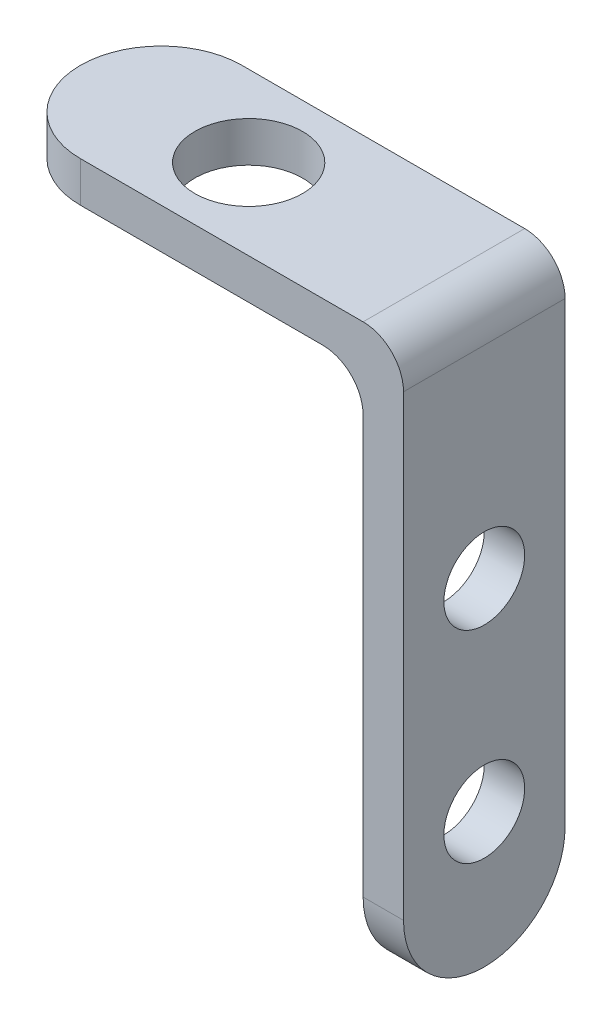
ISO-10303-21;
HEADER;
FILE_DESCRIPTION(('STEP AP214'),'2;1');
FILE_NAME('part.step','',(''),(''),'','','');
FILE_SCHEMA(('AUTOMOTIVE_DESIGN { 1 0 10303 214 1 1 1 1 }'));
ENDSEC;
DATA;
#1=APPLICATION_CONTEXT('core data for automotive mechanical design processes');
#2=APPLICATION_PROTOCOL_DEFINITION('international standard','automotive_design',2000,#1);
#3=PRODUCT_CONTEXT('',#1,'mechanical');
#4=PRODUCT('Part','Part','',(#3));
#5=PRODUCT_RELATED_PRODUCT_CATEGORY('part','',(#4));
#6=PRODUCT_DEFINITION_FORMATION('','',#4);
#7=PRODUCT_DEFINITION_CONTEXT('part definition',#1,'design');
#8=PRODUCT_DEFINITION('design','',#6,#7);
#9=PRODUCT_DEFINITION_SHAPE('','',#8);
#10=(LENGTH_UNIT() NAMED_UNIT(*) SI_UNIT(.MILLI.,.METRE.));
#11=(NAMED_UNIT(*) PLANE_ANGLE_UNIT() SI_UNIT($,.RADIAN.));
#12=(NAMED_UNIT(*) SI_UNIT($,.STERADIAN.) SOLID_ANGLE_UNIT());
#13=UNCERTAINTY_MEASURE_WITH_UNIT(LENGTH_MEASURE(1.E-05),#10,'distance_accuracy_value','');
#14=(GEOMETRIC_REPRESENTATION_CONTEXT(3) GLOBAL_UNCERTAINTY_ASSIGNED_CONTEXT((#13)) GLOBAL_UNIT_ASSIGNED_CONTEXT((#10,
#11,#12)) REPRESENTATION_CONTEXT('',''));
#15=CARTESIAN_POINT('',(0.,0.,0.));
#16=DIRECTION('',(0.,0.,1.));
#17=DIRECTION('',(1.,0.,0.));
#18=AXIS2_PLACEMENT_3D('',#15,#16,#17);
#19=CARTESIAN_POINT('',(0.,0.,0.));
#20=DIRECTION('',(0.,1.,0.));
#21=DIRECTION('',(0.,0.,1.));
#22=AXIS2_PLACEMENT_3D('',#19,#20,#21);
#23=PLANE('',#22);
#24=CARTESIAN_POINT('',(-2.5,0.,0.));
#25=DIRECTION('',(0.,1.,0.));
#26=DIRECTION('',(0.,0.,1.));
#27=AXIS2_PLACEMENT_3D('',#24,#25,#26);
#28=CIRCLE('',#27,4.);
#29=CARTESIAN_POINT('',(-2.5,0.,4.));
#30=VERTEX_POINT('',#29);
#31=EDGE_CURVE('E200',#30,#30,#28,.T.);
#32=ORIENTED_EDGE('',*,*,#31,.T.);
#33=EDGE_LOOP('',(#32));
#34=FACE_BOUND('',#33,.T.);
#35=CARTESIAN_POINT('',(-8.99999999999999,0.,0.));
#36=DIRECTION('',(0.,1.,0.));
#37=DIRECTION('',(0.,0.,1.));
#38=AXIS2_PLACEMENT_3D('',#35,#36,#37);
#39=CIRCLE('',#38,6.);
#40=CARTESIAN_POINT('',(-9.,0.,6.));
#41=VERTEX_POINT('',#40);
#42=CARTESIAN_POINT('',(-15.,0.,0.));
#43=VERTEX_POINT('',#42);
#44=EDGE_CURVE('E158',#41,#43,#39,.F.);
#45=ORIENTED_EDGE('',*,*,#44,.T.);
#46=CARTESIAN_POINT('',(-8.99999999999999,0.,0.));
#47=DIRECTION('',(0.,1.,0.));
#48=DIRECTION('',(0.,0.,1.));
#49=AXIS2_PLACEMENT_3D('',#46,#47,#48);
#50=CIRCLE('',#49,6.);
#51=CARTESIAN_POINT('',(-8.99999999999999,0.,-6.));
#52=VERTEX_POINT('',#51);
#53=EDGE_CURVE('E160',#43,#52,#50,.F.);
#54=ORIENTED_EDGE('',*,*,#53,.T.);
#55=DIRECTION('',(-1.,0.,0.));
#56=VECTOR('',#55,1.);
#57=CARTESIAN_POINT('',(-15.,0.,-6.));
#58=LINE('',#57,#56);
#59=CARTESIAN_POINT('',(9.00000000000001,0.,-6.));
#60=VERTEX_POINT('',#59);
#61=EDGE_CURVE('E135',#60,#52,#58,.T.);
#62=ORIENTED_EDGE('',*,*,#61,.F.);
#63=DIRECTION('',(0.,0.,-1.));
#64=VECTOR('',#63,1.);
#65=CARTESIAN_POINT('',(9.00000000000001,0.,6.));
#66=LINE('',#65,#64);
#67=CARTESIAN_POINT('',(9.,0.,6.));
#68=VERTEX_POINT('',#67);
#69=EDGE_CURVE('E150',#60,#68,#66,.F.);
#70=ORIENTED_EDGE('',*,*,#69,.T.);
#71=DIRECTION('',(1.,0.,0.));
#72=VECTOR('',#71,1.);
#73=CARTESIAN_POINT('',(-15.,0.,6.));
#74=LINE('',#73,#72);
#75=EDGE_CURVE('E131',#41,#68,#74,.T.);
#76=ORIENTED_EDGE('',*,*,#75,.F.);
#77=EDGE_LOOP('',(#45,#54,#62,#70,#76));
#78=FACE_BOUND('',#77,.T.);
#79=ADVANCED_FACE('F33',(#34,#78),#23,.F.);
#80=CARTESIAN_POINT('',(15.,3.,-6.));
#81=DIRECTION('',(-1.,0.,0.));
#82=DIRECTION('',(0.,0.,1.));
#83=AXIS2_PLACEMENT_3D('',#80,#81,#82);
#84=PLANE('',#83);
#85=CARTESIAN_POINT('',(15.,-15.,0.));
#86=DIRECTION('',(-1.,0.,0.));
#87=DIRECTION('',(0.,0.,1.));
#88=AXIS2_PLACEMENT_3D('',#85,#86,#87);
#89=CIRCLE('',#88,3.);
#90=CARTESIAN_POINT('',(15.,-15.,3.));
#91=VERTEX_POINT('',#90);
#92=EDGE_CURVE('E207',#91,#91,#89,.T.);
#93=ORIENTED_EDGE('',*,*,#92,.T.);
#94=EDGE_LOOP('',(#93));
#95=FACE_BOUND('',#94,.T.);
#96=CARTESIAN_POINT('',(15.,-30.,0.));
#97=DIRECTION('',(-1.,0.,0.));
#98=DIRECTION('',(0.,0.,1.));
#99=AXIS2_PLACEMENT_3D('',#96,#97,#98);
#100=CIRCLE('',#99,3.);
#101=CARTESIAN_POINT('',(15.,-30.,3.));
#102=VERTEX_POINT('',#101);
#103=EDGE_CURVE('E210',#102,#102,#100,.T.);
#104=ORIENTED_EDGE('',*,*,#103,.T.);
#105=EDGE_LOOP('',(#104));
#106=FACE_BOUND('',#105,.T.);
#107=DIRECTION('',(0.,-1.,0.));
#108=VECTOR('',#107,1.);
#109=CARTESIAN_POINT('',(15.,3.,6.));
#110=LINE('',#109,#108);
#111=CARTESIAN_POINT('',(15.,0.,6.));
#112=VERTEX_POINT('',#111);
#113=CARTESIAN_POINT('',(15.,-34.,6.));
#114=VERTEX_POINT('',#113);
#115=EDGE_CURVE('E133',#112,#114,#110,.T.);
#116=ORIENTED_EDGE('',*,*,#115,.T.);
#117=CARTESIAN_POINT('',(15.,-34.,0.));
#118=DIRECTION('',(-1.,0.,0.));
#119=DIRECTION('',(0.,0.,1.));
#120=AXIS2_PLACEMENT_3D('',#117,#118,#119);
#121=CIRCLE('',#120,6.);
#122=CARTESIAN_POINT('',(15.,-40.,0.));
#123=VERTEX_POINT('',#122);
#124=EDGE_CURVE('E42',#114,#123,#121,.F.);
#125=ORIENTED_EDGE('',*,*,#124,.T.);
#126=CARTESIAN_POINT('',(15.,-34.,0.));
#127=DIRECTION('',(-1.,0.,0.));
#128=DIRECTION('',(0.,0.,1.));
#129=AXIS2_PLACEMENT_3D('',#126,#127,#128);
#130=CIRCLE('',#129,6.);
#131=CARTESIAN_POINT('',(15.,-34.,-6.));
#132=VERTEX_POINT('',#131);
#133=EDGE_CURVE('E52',#123,#132,#130,.F.);
#134=ORIENTED_EDGE('',*,*,#133,.T.);
#135=DIRECTION('',(0.,-1.,0.));
#136=VECTOR('',#135,1.);
#137=CARTESIAN_POINT('',(15.,3.,-6.));
#138=LINE('',#137,#136);
#139=CARTESIAN_POINT('',(15.,0.,-6.));
#140=VERTEX_POINT('',#139);
#141=EDGE_CURVE('E124',#140,#132,#138,.T.);
#142=ORIENTED_EDGE('',*,*,#141,.F.);
#143=DIRECTION('',(0.,0.,-1.));
#144=VECTOR('',#143,1.);
#145=CARTESIAN_POINT('',(15.,0.,6.));
#146=LINE('',#145,#144);
#147=EDGE_CURVE('E113',#140,#112,#146,.F.);
#148=ORIENTED_EDGE('',*,*,#147,.T.);
#149=EDGE_LOOP('',(#116,#125,#134,#142,#148));
#150=FACE_BOUND('',#149,.T.);
#151=ADVANCED_FACE('F188',(#95,#106,#150),#84,.F.);
#152=CARTESIAN_POINT('',(-15.,3.,-6.));
#153=DIRECTION('',(0.,0.,1.));
#154=DIRECTION('',(1.,0.,0.));
#155=AXIS2_PLACEMENT_3D('',#152,#153,#154);
#156=PLANE('',#155);
#157=ORIENTED_EDGE('',*,*,#141,.T.);
#158=DIRECTION('',(1.,0.,0.));
#159=VECTOR('',#158,1.);
#160=CARTESIAN_POINT('',(-15.,-34.,-6.));
#161=LINE('',#160,#159);
#162=CARTESIAN_POINT('',(12.,-34.,-6.));
#163=VERTEX_POINT('',#162);
#164=EDGE_CURVE('E11',#132,#163,#161,.F.);
#165=ORIENTED_EDGE('',*,*,#164,.T.);
#166=DIRECTION('',(0.,1.,0.));
#167=VECTOR('',#166,1.);
#168=CARTESIAN_POINT('',(12.,-40.,-6.));
#169=LINE('',#168,#167);
#170=CARTESIAN_POINT('',(12.,-3.,-6.));
#171=VERTEX_POINT('',#170);
#172=EDGE_CURVE('E197',#163,#171,#169,.T.);
#173=ORIENTED_EDGE('',*,*,#172,.T.);
#174=CARTESIAN_POINT('',(9.00000000000001,-3.,-6.));
#175=DIRECTION('',(0.,0.,1.));
#176=DIRECTION('',(1.,0.,0.));
#177=AXIS2_PLACEMENT_3D('',#174,#175,#176);
#178=CIRCLE('',#177,3.);
#179=EDGE_CURVE('E153',#171,#60,#178,.T.);
#180=ORIENTED_EDGE('',*,*,#179,.T.);
#181=ORIENTED_EDGE('',*,*,#61,.T.);
#182=DIRECTION('',(0.,-1.,0.));
#183=VECTOR('',#182,1.);
#184=CARTESIAN_POINT('',(-8.99999999999999,3.,-6.));
#185=LINE('',#184,#183);
#186=CARTESIAN_POINT('',(-8.99999999999999,3.,-6.));
#187=VERTEX_POINT('',#186);
#188=EDGE_CURVE('E130',#52,#187,#185,.F.);
#189=ORIENTED_EDGE('',*,*,#188,.T.);
#190=DIRECTION('',(-1.,0.,0.));
#191=VECTOR('',#190,1.);
#192=CARTESIAN_POINT('',(-15.,3.,-6.));
#193=LINE('',#192,#191);
#194=CARTESIAN_POINT('',(12.,3.,-6.));
#195=VERTEX_POINT('',#194);
#196=EDGE_CURVE('E120',#195,#187,#193,.T.);
#197=ORIENTED_EDGE('',*,*,#196,.F.);
#198=CARTESIAN_POINT('',(12.,0.,-6.));
#199=DIRECTION('',(0.,0.,1.));
#200=DIRECTION('',(1.,0.,0.));
#201=AXIS2_PLACEMENT_3D('',#198,#199,#200);
#202=CIRCLE('',#201,3.);
#203=EDGE_CURVE('E108',#195,#140,#202,.F.);
#204=ORIENTED_EDGE('',*,*,#203,.T.);
#205=EDGE_LOOP('',(#157,#165,#173,#180,#181,#189,#197,#204));
#206=FACE_BOUND('',#205,.T.);
#207=ADVANCED_FACE('F127',(#206),#156,.F.);
#208=CARTESIAN_POINT('',(-15.,3.,6.));
#209=DIRECTION('',(0.,0.,-1.));
#210=DIRECTION('',(-1.,0.,0.));
#211=AXIS2_PLACEMENT_3D('',#208,#209,#210);
#212=PLANE('',#211);
#213=DIRECTION('',(0.,1.,0.));
#214=VECTOR('',#213,1.);
#215=CARTESIAN_POINT('',(12.,-40.,6.));
#216=LINE('',#215,#214);
#217=CARTESIAN_POINT('',(12.,-34.,6.));
#218=VERTEX_POINT('',#217);
#219=CARTESIAN_POINT('',(12.,-3.,6.));
#220=VERTEX_POINT('',#219);
#221=EDGE_CURVE('E138',#218,#220,#216,.T.);
#222=ORIENTED_EDGE('',*,*,#221,.F.);
#223=DIRECTION('',(-1.,0.,0.));
#224=VECTOR('',#223,1.);
#225=CARTESIAN_POINT('',(-15.,-34.,6.));
#226=LINE('',#225,#224);
#227=EDGE_CURVE('E177',#218,#114,#226,.F.);
#228=ORIENTED_EDGE('',*,*,#227,.T.);
#229=ORIENTED_EDGE('',*,*,#115,.F.);
#230=CARTESIAN_POINT('',(12.,0.,6.));
#231=DIRECTION('',(0.,0.,-1.));
#232=DIRECTION('',(-1.,0.,0.));
#233=AXIS2_PLACEMENT_3D('',#230,#231,#232);
#234=CIRCLE('',#233,3.);
#235=CARTESIAN_POINT('',(12.,3.,6.));
#236=VERTEX_POINT('',#235);
#237=EDGE_CURVE('E145',#112,#236,#234,.F.);
#238=ORIENTED_EDGE('',*,*,#237,.T.);
#239=DIRECTION('',(1.,0.,0.));
#240=VECTOR('',#239,1.);
#241=CARTESIAN_POINT('',(-15.,3.,6.));
#242=LINE('',#241,#240);
#243=CARTESIAN_POINT('',(-9.,3.,6.));
#244=VERTEX_POINT('',#243);
#245=EDGE_CURVE('E122',#244,#236,#242,.T.);
#246=ORIENTED_EDGE('',*,*,#245,.F.);
#247=DIRECTION('',(0.,-1.,0.));
#248=VECTOR('',#247,1.);
#249=CARTESIAN_POINT('',(-8.99999999999999,3.,6.));
#250=LINE('',#249,#248);
#251=EDGE_CURVE('E167',#244,#41,#250,.T.);
#252=ORIENTED_EDGE('',*,*,#251,.T.);
#253=ORIENTED_EDGE('',*,*,#75,.T.);
#254=CARTESIAN_POINT('',(9.00000000000001,-3.,6.));
#255=DIRECTION('',(0.,0.,-1.));
#256=DIRECTION('',(-1.,0.,0.));
#257=AXIS2_PLACEMENT_3D('',#254,#255,#256);
#258=CIRCLE('',#257,3.);
#259=EDGE_CURVE('E155',#68,#220,#258,.T.);
#260=ORIENTED_EDGE('',*,*,#259,.T.);
#261=EDGE_LOOP('',(#222,#228,#229,#238,#246,#252,#253,#260));
#262=FACE_BOUND('',#261,.T.);
#263=ADVANCED_FACE('F185',(#262),#212,.F.);
#264=CARTESIAN_POINT('',(0.,3.,0.));
#265=DIRECTION('',(0.,1.,0.));
#266=DIRECTION('',(0.,0.,1.));
#267=AXIS2_PLACEMENT_3D('',#264,#265,#266);
#268=PLANE('',#267);
#269=CARTESIAN_POINT('',(-2.5,3.,0.));
#270=DIRECTION('',(0.,1.,0.));
#271=DIRECTION('',(0.,0.,1.));
#272=AXIS2_PLACEMENT_3D('',#269,#270,#271);
#273=CIRCLE('',#272,4.);
#274=CARTESIAN_POINT('',(-2.5,3.,4.));
#275=VERTEX_POINT('',#274);
#276=EDGE_CURVE('E202',#275,#275,#273,.T.);
#277=ORIENTED_EDGE('',*,*,#276,.F.);
#278=EDGE_LOOP('',(#277));
#279=FACE_BOUND('',#278,.T.);
#280=ORIENTED_EDGE('',*,*,#196,.T.);
#281=CARTESIAN_POINT('',(-8.99999999999999,3.,0.));
#282=DIRECTION('',(0.,1.,0.));
#283=DIRECTION('',(0.,0.,1.));
#284=AXIS2_PLACEMENT_3D('',#281,#282,#283);
#285=CIRCLE('',#284,6.);
#286=CARTESIAN_POINT('',(-15.,3.,0.));
#287=VERTEX_POINT('',#286);
#288=EDGE_CURVE('E165',#187,#287,#285,.T.);
#289=ORIENTED_EDGE('',*,*,#288,.T.);
#290=CARTESIAN_POINT('',(-8.99999999999999,3.,0.));
#291=DIRECTION('',(0.,1.,0.));
#292=DIRECTION('',(0.,0.,1.));
#293=AXIS2_PLACEMENT_3D('',#290,#291,#292);
#294=CIRCLE('',#293,6.);
#295=EDGE_CURVE('E163',#287,#244,#294,.T.);
#296=ORIENTED_EDGE('',*,*,#295,.T.);
#297=ORIENTED_EDGE('',*,*,#245,.T.);
#298=DIRECTION('',(0.,0.,-1.));
#299=VECTOR('',#298,1.);
#300=CARTESIAN_POINT('',(12.,3.,-6.));
#301=LINE('',#300,#299);
#302=EDGE_CURVE('E112',#236,#195,#301,.T.);
#303=ORIENTED_EDGE('',*,*,#302,.T.);
#304=EDGE_LOOP('',(#280,#289,#296,#297,#303));
#305=FACE_BOUND('',#304,.T.);
#306=ADVANCED_FACE('F119',(#279,#305),#268,.T.);
#307=CARTESIAN_POINT('',(12.,-40.,6.));
#308=DIRECTION('',(1.,0.,0.));
#309=DIRECTION('',(0.,0.,-1.));
#310=AXIS2_PLACEMENT_3D('',#307,#308,#309);
#311=PLANE('',#310);
#312=CARTESIAN_POINT('',(12.,-15.,0.));
#313=DIRECTION('',(-1.,0.,0.));
#314=DIRECTION('',(0.,0.,1.));
#315=AXIS2_PLACEMENT_3D('',#312,#313,#314);
#316=CIRCLE('',#315,3.);
#317=CARTESIAN_POINT('',(12.,-15.,3.));
#318=VERTEX_POINT('',#317);
#319=EDGE_CURVE('E213',#318,#318,#316,.T.);
#320=ORIENTED_EDGE('',*,*,#319,.F.);
#321=EDGE_LOOP('',(#320));
#322=FACE_BOUND('',#321,.T.);
#323=CARTESIAN_POINT('',(12.,-30.,0.));
#324=DIRECTION('',(-1.,0.,0.));
#325=DIRECTION('',(0.,0.,1.));
#326=AXIS2_PLACEMENT_3D('',#323,#324,#325);
#327=CIRCLE('',#326,3.);
#328=CARTESIAN_POINT('',(12.,-30.,3.));
#329=VERTEX_POINT('',#328);
#330=EDGE_CURVE('E173',#329,#329,#327,.T.);
#331=ORIENTED_EDGE('',*,*,#330,.F.);
#332=EDGE_LOOP('',(#331));
#333=FACE_BOUND('',#332,.T.);
#334=CARTESIAN_POINT('',(12.,-34.,0.));
#335=DIRECTION('',(1.,0.,0.));
#336=DIRECTION('',(0.,0.,-1.));
#337=AXIS2_PLACEMENT_3D('',#334,#335,#336);
#338=CIRCLE('',#337,6.);
#339=CARTESIAN_POINT('',(12.,-40.,0.));
#340=VERTEX_POINT('',#339);
#341=EDGE_CURVE('E169',#163,#340,#338,.F.);
#342=ORIENTED_EDGE('',*,*,#341,.T.);
#343=CARTESIAN_POINT('',(12.,-34.,0.));
#344=DIRECTION('',(1.,0.,0.));
#345=DIRECTION('',(0.,0.,-1.));
#346=AXIS2_PLACEMENT_3D('',#343,#344,#345);
#347=CIRCLE('',#346,6.);
#348=EDGE_CURVE('E175',#340,#218,#347,.F.);
#349=ORIENTED_EDGE('',*,*,#348,.T.);
#350=ORIENTED_EDGE('',*,*,#221,.T.);
#351=DIRECTION('',(0.,0.,-1.));
#352=VECTOR('',#351,1.);
#353=CARTESIAN_POINT('',(12.,-3.,-6.));
#354=LINE('',#353,#352);
#355=EDGE_CURVE('E147',#220,#171,#354,.T.);
#356=ORIENTED_EDGE('',*,*,#355,.T.);
#357=ORIENTED_EDGE('',*,*,#172,.F.);
#358=EDGE_LOOP('',(#342,#349,#350,#356,#357));
#359=FACE_BOUND('',#358,.T.);
#360=ADVANCED_FACE('F196',(#322,#333,#359),#311,.F.);
#361=CARTESIAN_POINT('',(12.,0.,0.));
#362=DIRECTION('',(0.,0.,1.));
#363=DIRECTION('',(1.,0.,0.));
#364=AXIS2_PLACEMENT_3D('',#361,#362,#363);
#365=CYLINDRICAL_SURFACE('',#364,3.);
#366=ORIENTED_EDGE('',*,*,#237,.F.);
#367=ORIENTED_EDGE('',*,*,#147,.F.);
#368=ORIENTED_EDGE('',*,*,#203,.F.);
#369=ORIENTED_EDGE('',*,*,#302,.F.);
#370=EDGE_LOOP('',(#366,#367,#368,#369));
#371=FACE_BOUND('',#370,.T.);
#372=ADVANCED_FACE('F111',(#371),#365,.T.);
#373=CARTESIAN_POINT('',(9.00000000000001,-3.,6.));
#374=DIRECTION('',(0.,0.,1.));
#375=DIRECTION('',(1.,0.,0.));
#376=AXIS2_PLACEMENT_3D('',#373,#374,#375);
#377=CYLINDRICAL_SURFACE('',#376,3.);
#378=ORIENTED_EDGE('',*,*,#259,.F.);
#379=ORIENTED_EDGE('',*,*,#69,.F.);
#380=ORIENTED_EDGE('',*,*,#179,.F.);
#381=ORIENTED_EDGE('',*,*,#355,.F.);
#382=EDGE_LOOP('',(#378,#379,#380,#381));
#383=FACE_BOUND('',#382,.T.);
#384=ADVANCED_FACE('F241',(#383),#377,.F.);
#385=CARTESIAN_POINT('',(-2.5,-37.,0.));
#386=DIRECTION('',(0.,1.,0.));
#387=DIRECTION('',(0.,0.,1.));
#388=AXIS2_PLACEMENT_3D('',#385,#386,#387);
#389=CYLINDRICAL_SURFACE('',#388,4.);
#390=ORIENTED_EDGE('',*,*,#276,.T.);
#391=EDGE_LOOP('',(#390));
#392=FACE_BOUND('',#391,.T.);
#393=ORIENTED_EDGE('',*,*,#31,.F.);
#394=EDGE_LOOP('',(#393));
#395=FACE_BOUND('',#394,.T.);
#396=ADVANCED_FACE('F235',(#392,#395),#389,.F.);
#397=CARTESIAN_POINT('',(15.,-30.,0.));
#398=DIRECTION('',(-1.,0.,0.));
#399=DIRECTION('',(0.,0.,1.));
#400=AXIS2_PLACEMENT_3D('',#397,#398,#399);
#401=CYLINDRICAL_SURFACE('',#400,3.);
#402=ORIENTED_EDGE('',*,*,#103,.F.);
#403=EDGE_LOOP('',(#402));
#404=FACE_BOUND('',#403,.T.);
#405=ORIENTED_EDGE('',*,*,#330,.T.);
#406=EDGE_LOOP('',(#405));
#407=FACE_BOUND('',#406,.T.);
#408=ADVANCED_FACE('F225',(#404,#407),#401,.F.);
#409=CARTESIAN_POINT('',(15.,-15.,0.));
#410=DIRECTION('',(-1.,0.,0.));
#411=DIRECTION('',(0.,0.,1.));
#412=AXIS2_PLACEMENT_3D('',#409,#410,#411);
#413=CYLINDRICAL_SURFACE('',#412,3.);
#414=ORIENTED_EDGE('',*,*,#92,.F.);
#415=EDGE_LOOP('',(#414));
#416=FACE_BOUND('',#415,.T.);
#417=ORIENTED_EDGE('',*,*,#319,.T.);
#418=EDGE_LOOP('',(#417));
#419=FACE_BOUND('',#418,.T.);
#420=ADVANCED_FACE('F221',(#416,#419),#413,.F.);
#421=CARTESIAN_POINT('',(-8.99999999999999,3.,0.));
#422=DIRECTION('',(0.,-1.,0.));
#423=DIRECTION('',(0.,0.,-1.));
#424=AXIS2_PLACEMENT_3D('',#421,#422,#423);
#425=CYLINDRICAL_SURFACE('',#424,6.);
#426=ORIENTED_EDGE('',*,*,#251,.F.);
#427=ORIENTED_EDGE('',*,*,#295,.F.);
#428=DIRECTION('',(0.,-1.,0.));
#429=VECTOR('',#428,1.);
#430=CARTESIAN_POINT('',(-15.,3.,0.));
#431=LINE('',#430,#429);
#432=EDGE_CURVE('E170',#43,#287,#431,.F.);
#433=ORIENTED_EDGE('',*,*,#432,.F.);
#434=ORIENTED_EDGE('',*,*,#44,.F.);
#435=EDGE_LOOP('',(#426,#427,#433,#434));
#436=FACE_BOUND('',#435,.T.);
#437=ADVANCED_FACE('F224',(#436),#425,.T.);
#438=CARTESIAN_POINT('',(-8.99999999999999,3.,0.));
#439=DIRECTION('',(0.,-1.,0.));
#440=DIRECTION('',(0.,0.,-1.));
#441=AXIS2_PLACEMENT_3D('',#438,#439,#440);
#442=CYLINDRICAL_SURFACE('',#441,6.);
#443=ORIENTED_EDGE('',*,*,#288,.F.);
#444=ORIENTED_EDGE('',*,*,#188,.F.);
#445=ORIENTED_EDGE('',*,*,#53,.F.);
#446=ORIENTED_EDGE('',*,*,#432,.T.);
#447=EDGE_LOOP('',(#443,#444,#445,#446));
#448=FACE_BOUND('',#447,.T.);
#449=ADVANCED_FACE('F264',(#448),#442,.T.);
#450=CARTESIAN_POINT('',(0.,-34.,0.));
#451=DIRECTION('',(1.,0.,0.));
#452=DIRECTION('',(0.,0.,-1.));
#453=AXIS2_PLACEMENT_3D('',#450,#451,#452);
#454=CYLINDRICAL_SURFACE('',#453,6.);
#455=ORIENTED_EDGE('',*,*,#164,.F.);
#456=ORIENTED_EDGE('',*,*,#133,.F.);
#457=DIRECTION('',(1.,0.,0.));
#458=VECTOR('',#457,1.);
#459=CARTESIAN_POINT('',(0.,-40.,0.));
#460=LINE('',#459,#458);
#461=EDGE_CURVE('E37',#340,#123,#460,.T.);
#462=ORIENTED_EDGE('',*,*,#461,.F.);
#463=ORIENTED_EDGE('',*,*,#341,.F.);
#464=EDGE_LOOP('',(#455,#456,#462,#463));
#465=FACE_BOUND('',#464,.T.);
#466=ADVANCED_FACE('F35',(#465),#454,.T.);
#467=CARTESIAN_POINT('',(0.,-34.,0.));
#468=DIRECTION('',(-1.,0.,0.));
#469=DIRECTION('',(0.,0.,1.));
#470=AXIS2_PLACEMENT_3D('',#467,#468,#469);
#471=CYLINDRICAL_SURFACE('',#470,6.);
#472=ORIENTED_EDGE('',*,*,#124,.F.);
#473=ORIENTED_EDGE('',*,*,#227,.F.);
#474=ORIENTED_EDGE('',*,*,#348,.F.);
#475=ORIENTED_EDGE('',*,*,#461,.T.);
#476=EDGE_LOOP('',(#472,#473,#474,#475));
#477=FACE_BOUND('',#476,.T.);
#478=ADVANCED_FACE('F270',(#477),#471,.T.);
#479=CLOSED_SHELL('',(#79,#151,#207,#263,#306,#360,#372,#384,#396,#408,#420,#437,#449,#466,#478));
#480=MANIFOLD_SOLID_BREP('B2',#479);
#481=ADVANCED_BREP_SHAPE_REPRESENTATION('',(#18,#480),#14);
#482=SHAPE_DEFINITION_REPRESENTATION(#9,#481);
ENDSEC;
END-ISO-10303-21;
